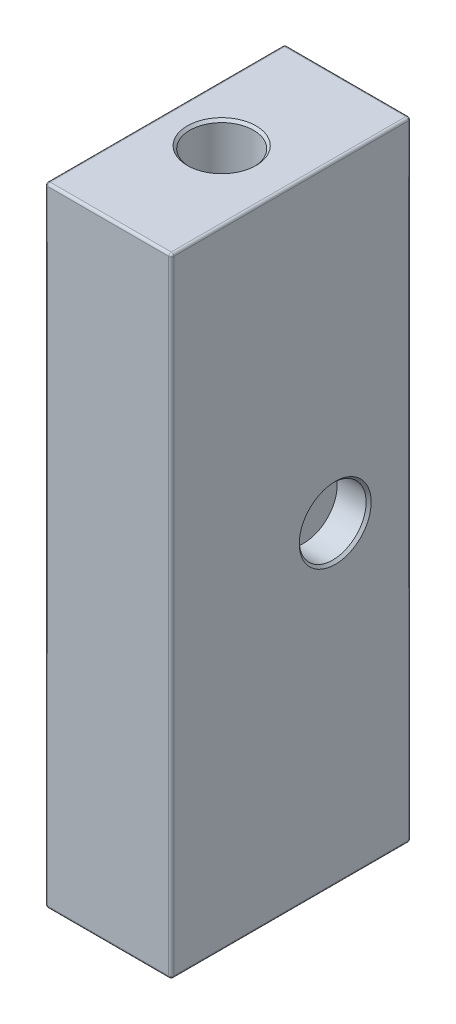
ISO-10303-21;
HEADER;
FILE_DESCRIPTION(('STEP AP214'),'2;1');
FILE_NAME('part.step','',(''),(''),'','','');
FILE_SCHEMA(('AUTOMOTIVE_DESIGN { 1 0 10303 214 1 1 1 1 }'));
ENDSEC;
DATA;
#1=APPLICATION_CONTEXT('core data for automotive mechanical design processes');
#2=APPLICATION_PROTOCOL_DEFINITION('international standard','automotive_design',2000,#1);
#3=PRODUCT_CONTEXT('',#1,'mechanical');
#4=PRODUCT('Part','Part','',(#3));
#5=PRODUCT_RELATED_PRODUCT_CATEGORY('part','',(#4));
#6=PRODUCT_DEFINITION_FORMATION('','',#4);
#7=PRODUCT_DEFINITION_CONTEXT('part definition',#1,'design');
#8=PRODUCT_DEFINITION('design','',#6,#7);
#9=PRODUCT_DEFINITION_SHAPE('','',#8);
#10=(LENGTH_UNIT() NAMED_UNIT(*) SI_UNIT(.MILLI.,.METRE.));
#11=(NAMED_UNIT(*) PLANE_ANGLE_UNIT() SI_UNIT($,.RADIAN.));
#12=(NAMED_UNIT(*) SI_UNIT($,.STERADIAN.) SOLID_ANGLE_UNIT());
#13=UNCERTAINTY_MEASURE_WITH_UNIT(LENGTH_MEASURE(1.E-05),#10,'distance_accuracy_value','');
#14=(GEOMETRIC_REPRESENTATION_CONTEXT(3) GLOBAL_UNCERTAINTY_ASSIGNED_CONTEXT((#13)) GLOBAL_UNIT_ASSIGNED_CONTEXT((#10,
#11,#12)) REPRESENTATION_CONTEXT('',''));
#15=CARTESIAN_POINT('',(0.,0.,0.));
#16=DIRECTION('',(0.,0.,1.));
#17=DIRECTION('',(1.,0.,0.));
#18=AXIS2_PLACEMENT_3D('',#15,#16,#17);
#19=CARTESIAN_POINT('',(0.,24.9,0.));
#20=DIRECTION('',(0.,1.,0.));
#21=DIRECTION('',(0.,0.,1.));
#22=AXIS2_PLACEMENT_3D('',#19,#20,#21);
#23=PLANE('',#22);
#24=CARTESIAN_POINT('',(-0.5,24.9,0.));
#25=DIRECTION('',(0.,1.,0.));
#26=DIRECTION('',(0.,0.,1.));
#27=AXIS2_PLACEMENT_3D('',#24,#25,#26);
#28=CIRCLE('',#27,2.72499999999999);
#29=CARTESIAN_POINT('',(-0.5,24.9,2.72500000000001));
#30=VERTEX_POINT('',#29);
#31=EDGE_CURVE('E11',#30,#30,#28,.F.);
#32=ORIENTED_EDGE('',*,*,#31,.T.);
#33=EDGE_LOOP('',(#32));
#34=FACE_BOUND('',#33,.T.);
#35=DIRECTION('',(-1.,0.,0.));
#36=VECTOR('',#35,1.);
#37=CARTESIAN_POINT('',(-5.,24.9,-9.3));
#38=LINE('',#37,#36);
#39=CARTESIAN_POINT('',(4.8,24.9,-9.3));
#40=VERTEX_POINT('',#39);
#41=CARTESIAN_POINT('',(-4.8,24.9,-9.3));
#42=VERTEX_POINT('',#41);
#43=EDGE_CURVE('E438',#40,#42,#38,.T.);
#44=ORIENTED_EDGE('',*,*,#43,.T.);
#45=DIRECTION('',(0.,0.,1.));
#46=VECTOR('',#45,1.);
#47=CARTESIAN_POINT('',(-4.8,24.9,9.5));
#48=LINE('',#47,#46);
#49=CARTESIAN_POINT('',(-4.8,24.9,9.3));
#50=VERTEX_POINT('',#49);
#51=EDGE_CURVE('E442',#42,#50,#48,.T.);
#52=ORIENTED_EDGE('',*,*,#51,.T.);
#53=DIRECTION('',(1.,0.,0.));
#54=VECTOR('',#53,1.);
#55=CARTESIAN_POINT('',(5.,24.9,9.3));
#56=LINE('',#55,#54);
#57=CARTESIAN_POINT('',(4.8,24.9,9.3));
#58=VERTEX_POINT('',#57);
#59=EDGE_CURVE('E435',#50,#58,#56,.T.);
#60=ORIENTED_EDGE('',*,*,#59,.T.);
#61=DIRECTION('',(0.,0.,-1.));
#62=VECTOR('',#61,1.);
#63=CARTESIAN_POINT('',(4.8,24.9,-9.5));
#64=LINE('',#63,#62);
#65=EDGE_CURVE('E418',#58,#40,#64,.T.);
#66=ORIENTED_EDGE('',*,*,#65,.T.);
#67=EDGE_LOOP('',(#44,#52,#60,#66));
#68=FACE_BOUND('',#67,.T.);
#69=ADVANCED_FACE('F45',(#34,#68),#23,.T.);
#70=CARTESIAN_POINT('',(0.,-24.9,0.));
#71=DIRECTION('',(0.,1.,0.));
#72=DIRECTION('',(0.,0.,1.));
#73=AXIS2_PLACEMENT_3D('',#70,#71,#72);
#74=PLANE('',#73);
#75=DIRECTION('',(1.,0.,0.));
#76=VECTOR('',#75,1.);
#77=CARTESIAN_POINT('',(0.,-24.9,9.3));
#78=LINE('',#77,#76);
#79=CARTESIAN_POINT('',(4.8,-24.9,9.3));
#80=VERTEX_POINT('',#79);
#81=CARTESIAN_POINT('',(-4.8,-24.9,9.3));
#82=VERTEX_POINT('',#81);
#83=EDGE_CURVE('E448',#80,#82,#78,.F.);
#84=ORIENTED_EDGE('',*,*,#83,.T.);
#85=DIRECTION('',(0.,0.,1.));
#86=VECTOR('',#85,1.);
#87=CARTESIAN_POINT('',(-4.8,-24.9,0.));
#88=LINE('',#87,#86);
#89=CARTESIAN_POINT('',(-4.8,-24.9,-9.3));
#90=VERTEX_POINT('',#89);
#91=EDGE_CURVE('E453',#82,#90,#88,.F.);
#92=ORIENTED_EDGE('',*,*,#91,.T.);
#93=DIRECTION('',(-1.,0.,0.));
#94=VECTOR('',#93,1.);
#95=CARTESIAN_POINT('',(0.,-24.9,-9.3));
#96=LINE('',#95,#94);
#97=CARTESIAN_POINT('',(4.8,-24.9,-9.3));
#98=VERTEX_POINT('',#97);
#99=EDGE_CURVE('E172',#90,#98,#96,.F.);
#100=ORIENTED_EDGE('',*,*,#99,.T.);
#101=DIRECTION('',(0.,0.,-1.));
#102=VECTOR('',#101,1.);
#103=CARTESIAN_POINT('',(4.8,-24.9,0.));
#104=LINE('',#103,#102);
#105=EDGE_CURVE('E445',#98,#80,#104,.F.);
#106=ORIENTED_EDGE('',*,*,#105,.T.);
#107=EDGE_LOOP('',(#84,#92,#100,#106));
#108=FACE_BOUND('',#107,.T.);
#109=CARTESIAN_POINT('',(-0.5,-24.9,0.));
#110=DIRECTION('',(0.,1.,0.));
#111=DIRECTION('',(0.,0.,1.));
#112=AXIS2_PLACEMENT_3D('',#109,#110,#111);
#113=CIRCLE('',#112,2.525);
#114=CARTESIAN_POINT('',(-0.5,-24.9,2.52500000000002));
#115=VERTEX_POINT('',#114);
#116=EDGE_CURVE('E159',#115,#115,#113,.T.);
#117=ORIENTED_EDGE('',*,*,#116,.T.);
#118=EDGE_LOOP('',(#117));
#119=FACE_BOUND('',#118,.T.);
#120=ADVANCED_FACE('F262',(#108,#119),#74,.F.);
#121=CARTESIAN_POINT('',(-5.,24.9,9.5));
#122=DIRECTION('',(1.,0.,0.));
#123=DIRECTION('',(0.,0.,-1.));
#124=AXIS2_PLACEMENT_3D('',#121,#122,#123);
#125=PLANE('',#124);
#126=DIRECTION('',(0.,0.,1.));
#127=VECTOR('',#126,1.);
#128=CARTESIAN_POINT('',(-5.,24.7,-9.5));
#129=LINE('',#128,#127);
#130=CARTESIAN_POINT('',(-5.,24.7,9.3));
#131=VERTEX_POINT('',#130);
#132=CARTESIAN_POINT('',(-5.,24.7,-9.3));
#133=VERTEX_POINT('',#132);
#134=EDGE_CURVE('E62',#131,#133,#129,.F.);
#135=ORIENTED_EDGE('',*,*,#134,.T.);
#136=DIRECTION('',(0.,-1.,0.));
#137=VECTOR('',#136,1.);
#138=CARTESIAN_POINT('',(-5.,24.9,-9.3));
#139=LINE('',#138,#137);
#140=CARTESIAN_POINT('',(-5.,-24.7,-9.3));
#141=VERTEX_POINT('',#140);
#142=EDGE_CURVE('E242',#133,#141,#139,.T.);
#143=ORIENTED_EDGE('',*,*,#142,.T.);
#144=DIRECTION('',(0.,0.,1.));
#145=VECTOR('',#144,1.);
#146=CARTESIAN_POINT('',(-5.,-24.7,9.5));
#147=LINE('',#146,#145);
#148=CARTESIAN_POINT('',(-5.,-24.7,9.3));
#149=VERTEX_POINT('',#148);
#150=EDGE_CURVE('E385',#141,#149,#147,.T.);
#151=ORIENTED_EDGE('',*,*,#150,.T.);
#152=DIRECTION('',(0.,-1.,0.));
#153=VECTOR('',#152,1.);
#154=CARTESIAN_POINT('',(-5.,24.9,9.3));
#155=LINE('',#154,#153);
#156=EDGE_CURVE('E67',#149,#131,#155,.F.);
#157=ORIENTED_EDGE('',*,*,#156,.T.);
#158=EDGE_LOOP('',(#135,#143,#151,#157));
#159=FACE_BOUND('',#158,.T.);
#160=ADVANCED_FACE('F268',(#159),#125,.F.);
#161=CARTESIAN_POINT('',(5.,24.9,9.5));
#162=DIRECTION('',(0.,0.,-1.));
#163=DIRECTION('',(-1.,0.,0.));
#164=AXIS2_PLACEMENT_3D('',#161,#162,#163);
#165=PLANE('',#164);
#166=DIRECTION('',(0.,-1.,0.));
#167=VECTOR('',#166,1.);
#168=CARTESIAN_POINT('',(4.8,24.9,9.5));
#169=LINE('',#168,#167);
#170=CARTESIAN_POINT('',(4.8,-24.7,9.5));
#171=VERTEX_POINT('',#170);
#172=CARTESIAN_POINT('',(4.8,24.7,9.5));
#173=VERTEX_POINT('',#172);
#174=EDGE_CURVE('E461',#171,#173,#169,.F.);
#175=ORIENTED_EDGE('',*,*,#174,.T.);
#176=DIRECTION('',(1.,0.,0.));
#177=VECTOR('',#176,1.);
#178=CARTESIAN_POINT('',(-5.,24.7,9.5));
#179=LINE('',#178,#177);
#180=CARTESIAN_POINT('',(-4.8,24.7,9.5));
#181=VERTEX_POINT('',#180);
#182=EDGE_CURVE('E464',#173,#181,#179,.F.);
#183=ORIENTED_EDGE('',*,*,#182,.T.);
#184=DIRECTION('',(0.,-1.,0.));
#185=VECTOR('',#184,1.);
#186=CARTESIAN_POINT('',(-4.8,24.9,9.5));
#187=LINE('',#186,#185);
#188=CARTESIAN_POINT('',(-4.8,-24.7,9.5));
#189=VERTEX_POINT('',#188);
#190=EDGE_CURVE('E374',#181,#189,#187,.T.);
#191=ORIENTED_EDGE('',*,*,#190,.T.);
#192=DIRECTION('',(1.,0.,0.));
#193=VECTOR('',#192,1.);
#194=CARTESIAN_POINT('',(5.,-24.7,9.5));
#195=LINE('',#194,#193);
#196=EDGE_CURVE('E458',#189,#171,#195,.T.);
#197=ORIENTED_EDGE('',*,*,#196,.T.);
#198=EDGE_LOOP('',(#175,#183,#191,#197));
#199=FACE_BOUND('',#198,.T.);
#200=ADVANCED_FACE('F280',(#199),#165,.F.);
#201=CARTESIAN_POINT('',(5.,24.9,9.5));
#202=DIRECTION('',(-1.,0.,0.));
#203=DIRECTION('',(0.,0.,1.));
#204=AXIS2_PLACEMENT_3D('',#201,#202,#203);
#205=PLANE('',#204);
#206=CARTESIAN_POINT('',(5.,0.,-3.5));
#207=DIRECTION('',(-1.,0.,0.));
#208=DIRECTION('',(0.,0.,1.));
#209=AXIS2_PLACEMENT_3D('',#206,#207,#208);
#210=CIRCLE('',#209,2.84999999999999);
#211=CARTESIAN_POINT('',(5.,0.,-0.650000000000012));
#212=VERTEX_POINT('',#211);
#213=EDGE_CURVE('E241',#212,#212,#210,.T.);
#214=ORIENTED_EDGE('',*,*,#213,.T.);
#215=EDGE_LOOP('',(#214));
#216=FACE_BOUND('',#215,.T.);
#217=DIRECTION('',(0.,-1.,0.));
#218=VECTOR('',#217,1.);
#219=CARTESIAN_POINT('',(5.,24.9,-9.3));
#220=LINE('',#219,#218);
#221=CARTESIAN_POINT('',(5.,-24.7,-9.3));
#222=VERTEX_POINT('',#221);
#223=CARTESIAN_POINT('',(5.,24.7,-9.3));
#224=VERTEX_POINT('',#223);
#225=EDGE_CURVE('E419',#222,#224,#220,.F.);
#226=ORIENTED_EDGE('',*,*,#225,.T.);
#227=DIRECTION('',(0.,0.,-1.));
#228=VECTOR('',#227,1.);
#229=CARTESIAN_POINT('',(5.,24.7,9.5));
#230=LINE('',#229,#228);
#231=CARTESIAN_POINT('',(5.,24.7,9.3));
#232=VERTEX_POINT('',#231);
#233=EDGE_CURVE('E412',#224,#232,#230,.F.);
#234=ORIENTED_EDGE('',*,*,#233,.T.);
#235=DIRECTION('',(0.,-1.,0.));
#236=VECTOR('',#235,1.);
#237=CARTESIAN_POINT('',(5.,24.9,9.3));
#238=LINE('',#237,#236);
#239=CARTESIAN_POINT('',(5.,-24.7,9.3));
#240=VERTEX_POINT('',#239);
#241=EDGE_CURVE('E427',#232,#240,#238,.T.);
#242=ORIENTED_EDGE('',*,*,#241,.T.);
#243=DIRECTION('',(0.,0.,-1.));
#244=VECTOR('',#243,1.);
#245=CARTESIAN_POINT('',(5.,-24.7,9.5));
#246=LINE('',#245,#244);
#247=EDGE_CURVE('E423',#240,#222,#246,.T.);
#248=ORIENTED_EDGE('',*,*,#247,.T.);
#249=EDGE_LOOP('',(#226,#234,#242,#248));
#250=FACE_BOUND('',#249,.T.);
#251=ADVANCED_FACE('F277',(#216,#250),#205,.F.);
#252=CARTESIAN_POINT('',(5.,24.9,-9.5));
#253=DIRECTION('',(0.,0.,1.));
#254=DIRECTION('',(1.,0.,0.));
#255=AXIS2_PLACEMENT_3D('',#252,#253,#254);
#256=PLANE('',#255);
#257=DIRECTION('',(-1.,0.,0.));
#258=VECTOR('',#257,1.);
#259=CARTESIAN_POINT('',(5.,24.7,-9.5));
#260=LINE('',#259,#258);
#261=CARTESIAN_POINT('',(-4.8,24.7,-9.5));
#262=VERTEX_POINT('',#261);
#263=CARTESIAN_POINT('',(4.8,24.7,-9.5));
#264=VERTEX_POINT('',#263);
#265=EDGE_CURVE('E147',#262,#264,#260,.F.);
#266=ORIENTED_EDGE('',*,*,#265,.T.);
#267=DIRECTION('',(0.,-1.,0.));
#268=VECTOR('',#267,1.);
#269=CARTESIAN_POINT('',(4.8,24.9,-9.5));
#270=LINE('',#269,#268);
#271=CARTESIAN_POINT('',(4.8,-24.7,-9.5));
#272=VERTEX_POINT('',#271);
#273=EDGE_CURVE('E142',#264,#272,#270,.T.);
#274=ORIENTED_EDGE('',*,*,#273,.T.);
#275=DIRECTION('',(-1.,0.,0.));
#276=VECTOR('',#275,1.);
#277=CARTESIAN_POINT('',(5.,-24.7,-9.5));
#278=LINE('',#277,#276);
#279=CARTESIAN_POINT('',(-4.8,-24.7,-9.5));
#280=VERTEX_POINT('',#279);
#281=EDGE_CURVE('E136',#272,#280,#278,.T.);
#282=ORIENTED_EDGE('',*,*,#281,.T.);
#283=DIRECTION('',(0.,-1.,0.));
#284=VECTOR('',#283,1.);
#285=CARTESIAN_POINT('',(-4.8,24.9,-9.5));
#286=LINE('',#285,#284);
#287=EDGE_CURVE('E139',#280,#262,#286,.F.);
#288=ORIENTED_EDGE('',*,*,#287,.T.);
#289=EDGE_LOOP('',(#266,#274,#282,#288));
#290=FACE_BOUND('',#289,.T.);
#291=ADVANCED_FACE('F138',(#290),#256,.F.);
#292=CARTESIAN_POINT('',(-0.5,24.9,0.));
#293=DIRECTION('',(0.,-1.,0.));
#294=DIRECTION('',(0.,0.,-1.));
#295=AXIS2_PLACEMENT_3D('',#292,#293,#294);
#296=CYLINDRICAL_SURFACE('',#295,2.525);
#297=CARTESIAN_POINT('',(-0.5,24.7,0.));
#298=DIRECTION('',(0.,1.,0.));
#299=DIRECTION('',(0.,0.,1.));
#300=AXIS2_PLACEMENT_3D('',#297,#298,#299);
#301=CIRCLE('',#300,2.525);
#302=CARTESIAN_POINT('',(-0.5,24.7,2.52500000000002));
#303=VERTEX_POINT('',#302);
#304=EDGE_CURVE('E55',#303,#303,#301,.T.);
#305=ORIENTED_EDGE('',*,*,#304,.T.);
#306=EDGE_LOOP('',(#305));
#307=FACE_BOUND('',#306,.T.);
#308=ORIENTED_EDGE('',*,*,#116,.F.);
#309=EDGE_LOOP('',(#308));
#310=FACE_BOUND('',#309,.T.);
#311=ADVANCED_FACE('F249',(#307,#310),#296,.F.);
#312=CARTESIAN_POINT('',(2.5,0.,-3.5));
#313=DIRECTION('',(1.,0.,0.));
#314=DIRECTION('',(0.,0.,-1.));
#315=AXIS2_PLACEMENT_3D('',#312,#313,#314);
#316=CYLINDRICAL_SURFACE('',#315,2.65);
#317=CARTESIAN_POINT('',(4.8,0.,-3.5));
#318=DIRECTION('',(-1.,0.,0.));
#319=DIRECTION('',(0.,0.,1.));
#320=AXIS2_PLACEMENT_3D('',#317,#318,#319);
#321=CIRCLE('',#320,2.65);
#322=CARTESIAN_POINT('',(4.8,0.,-0.850000000000007));
#323=VERTEX_POINT('',#322);
#324=EDGE_CURVE('E237',#323,#323,#321,.F.);
#325=ORIENTED_EDGE('',*,*,#324,.T.);
#326=EDGE_LOOP('',(#325));
#327=FACE_BOUND('',#326,.T.);
#328=CARTESIAN_POINT('',(2.5,0.,-3.5));
#329=DIRECTION('',(1.,0.,0.));
#330=DIRECTION('',(0.,0.,-1.));
#331=AXIS2_PLACEMENT_3D('',#328,#329,#330);
#332=CIRCLE('',#331,2.65);
#333=CARTESIAN_POINT('',(2.5,0.,-6.15));
#334=VERTEX_POINT('',#333);
#335=EDGE_CURVE('E236',#334,#334,#332,.T.);
#336=ORIENTED_EDGE('',*,*,#335,.F.);
#337=EDGE_LOOP('',(#336));
#338=FACE_BOUND('',#337,.T.);
#339=ADVANCED_FACE('F368',(#327,#338),#316,.F.);
#340=CARTESIAN_POINT('',(2.5,0.,-3.5));
#341=DIRECTION('',(1.,0.,0.));
#342=DIRECTION('',(0.,0.,-1.));
#343=AXIS2_PLACEMENT_3D('',#340,#341,#342);
#344=PLANE('',#343);
#345=ORIENTED_EDGE('',*,*,#335,.T.);
#346=EDGE_LOOP('',(#345));
#347=FACE_BOUND('',#346,.T.);
#348=ADVANCED_FACE('F358',(#347),#344,.T.);
#349=CARTESIAN_POINT('',(-4.8,24.9,9.3));
#350=DIRECTION('',(0.,-1.,0.));
#351=DIRECTION('',(0.,0.,-1.));
#352=AXIS2_PLACEMENT_3D('',#349,#350,#351);
#353=CYLINDRICAL_SURFACE('',#352,0.2);
#354=CARTESIAN_POINT('',(-4.8,24.7,9.3));
#355=DIRECTION('',(0.,1.,0.));
#356=DIRECTION('',(0.,0.,1.));
#357=AXIS2_PLACEMENT_3D('',#354,#355,#356);
#358=CIRCLE('',#357,0.2);
#359=EDGE_CURVE('E232',#131,#181,#358,.T.);
#360=ORIENTED_EDGE('',*,*,#359,.F.);
#361=ORIENTED_EDGE('',*,*,#156,.F.);
#362=CARTESIAN_POINT('',(-4.8,-24.7,9.3));
#363=DIRECTION('',(0.,-1.,0.));
#364=DIRECTION('',(0.,0.,-1.));
#365=AXIS2_PLACEMENT_3D('',#362,#363,#364);
#366=CIRCLE('',#365,0.2);
#367=EDGE_CURVE('E228',#189,#149,#366,.T.);
#368=ORIENTED_EDGE('',*,*,#367,.F.);
#369=ORIENTED_EDGE('',*,*,#190,.F.);
#370=EDGE_LOOP('',(#360,#361,#368,#369));
#371=FACE_BOUND('',#370,.T.);
#372=ADVANCED_FACE('F355',(#371),#353,.T.);
#373=CARTESIAN_POINT('',(-4.8,24.7,9.3));
#374=DIRECTION('',(0.,0.,1.));
#375=DIRECTION('',(1.,0.,0.));
#376=AXIS2_PLACEMENT_3D('',#373,#374,#375);
#377=SPHERICAL_SURFACE('',#376,0.2);
#378=CARTESIAN_POINT('',(-4.8,24.7,9.3));
#379=DIRECTION('',(0.,0.,1.));
#380=DIRECTION('',(1.,0.,0.));
#381=AXIS2_PLACEMENT_3D('',#378,#379,#380);
#382=CIRCLE('',#381,0.2);
#383=EDGE_CURVE('E221',#131,#50,#382,.F.);
#384=ORIENTED_EDGE('',*,*,#383,.F.);
#385=ORIENTED_EDGE('',*,*,#359,.T.);
#386=CARTESIAN_POINT('',(-4.8,24.7,9.3));
#387=DIRECTION('',(-1.,0.,0.));
#388=DIRECTION('',(0.,-1.,0.));
#389=AXIS2_PLACEMENT_3D('',#386,#387,#388);
#390=CIRCLE('',#389,0.2);
#391=EDGE_CURVE('E225',#50,#181,#390,.F.);
#392=ORIENTED_EDGE('',*,*,#391,.F.);
#393=EDGE_LOOP('',(#384,#385,#392));
#394=FACE_BOUND('',#393,.T.);
#395=ADVANCED_FACE('F351',(#394),#377,.T.);
#396=CARTESIAN_POINT('',(-4.8,-24.7,9.3));
#397=DIRECTION('',(-1.,0.,0.));
#398=DIRECTION('',(0.,0.,1.));
#399=AXIS2_PLACEMENT_3D('',#396,#397,#398);
#400=SPHERICAL_SURFACE('',#399,0.2);
#401=CARTESIAN_POINT('',(-4.8,-24.7,9.3));
#402=DIRECTION('',(-1.,0.,0.));
#403=DIRECTION('',(0.,0.,1.));
#404=AXIS2_PLACEMENT_3D('',#401,#402,#403);
#405=CIRCLE('',#404,0.2);
#406=EDGE_CURVE('E213',#189,#82,#405,.F.);
#407=ORIENTED_EDGE('',*,*,#406,.F.);
#408=ORIENTED_EDGE('',*,*,#367,.T.);
#409=CARTESIAN_POINT('',(-4.8,-24.7,9.3));
#410=DIRECTION('',(0.,0.,1.));
#411=DIRECTION('',(1.,0.,0.));
#412=AXIS2_PLACEMENT_3D('',#409,#410,#411);
#413=CIRCLE('',#412,0.2);
#414=EDGE_CURVE('E217',#82,#149,#413,.F.);
#415=ORIENTED_EDGE('',*,*,#414,.F.);
#416=EDGE_LOOP('',(#407,#408,#415));
#417=FACE_BOUND('',#416,.T.);
#418=ADVANCED_FACE('F347',(#417),#400,.T.);
#419=CARTESIAN_POINT('',(0.,24.7,9.3));
#420=DIRECTION('',(-1.,0.,0.));
#421=DIRECTION('',(0.,0.,1.));
#422=AXIS2_PLACEMENT_3D('',#419,#420,#421);
#423=CYLINDRICAL_SURFACE('',#422,0.2);
#424=ORIENTED_EDGE('',*,*,#391,.T.);
#425=ORIENTED_EDGE('',*,*,#182,.F.);
#426=CARTESIAN_POINT('',(4.8,24.7,9.3));
#427=DIRECTION('',(1.,0.,0.));
#428=DIRECTION('',(0.,0.,-1.));
#429=AXIS2_PLACEMENT_3D('',#426,#427,#428);
#430=CIRCLE('',#429,0.2);
#431=EDGE_CURVE('E205',#58,#173,#430,.T.);
#432=ORIENTED_EDGE('',*,*,#431,.F.);
#433=ORIENTED_EDGE('',*,*,#59,.F.);
#434=EDGE_LOOP('',(#424,#425,#432,#433));
#435=FACE_BOUND('',#434,.T.);
#436=ADVANCED_FACE('F343',(#435),#423,.T.);
#437=CARTESIAN_POINT('',(-4.8,24.7,0.));
#438=DIRECTION('',(0.,0.,-1.));
#439=DIRECTION('',(-1.,0.,0.));
#440=AXIS2_PLACEMENT_3D('',#437,#438,#439);
#441=CYLINDRICAL_SURFACE('',#440,0.2);
#442=ORIENTED_EDGE('',*,*,#383,.T.);
#443=ORIENTED_EDGE('',*,*,#51,.F.);
#444=CARTESIAN_POINT('',(-4.8,24.7,-9.3));
#445=DIRECTION('',(0.,0.,-1.));
#446=DIRECTION('',(0.,1.,0.));
#447=AXIS2_PLACEMENT_3D('',#444,#445,#446);
#448=CIRCLE('',#447,0.2);
#449=EDGE_CURVE('E201',#133,#42,#448,.T.);
#450=ORIENTED_EDGE('',*,*,#449,.F.);
#451=ORIENTED_EDGE('',*,*,#134,.F.);
#452=EDGE_LOOP('',(#442,#443,#450,#451));
#453=FACE_BOUND('',#452,.T.);
#454=ADVANCED_FACE('F340',(#453),#441,.T.);
#455=CARTESIAN_POINT('',(-4.8,24.9,-9.3));
#456=DIRECTION('',(0.,-1.,0.));
#457=DIRECTION('',(0.,0.,-1.));
#458=AXIS2_PLACEMENT_3D('',#455,#456,#457);
#459=CYLINDRICAL_SURFACE('',#458,0.2);
#460=CARTESIAN_POINT('',(-4.8,-24.7,-9.3));
#461=DIRECTION('',(0.,-1.,0.));
#462=DIRECTION('',(0.,0.,-1.));
#463=AXIS2_PLACEMENT_3D('',#460,#461,#462);
#464=CIRCLE('',#463,0.2);
#465=EDGE_CURVE('E153',#141,#280,#464,.T.);
#466=ORIENTED_EDGE('',*,*,#465,.F.);
#467=ORIENTED_EDGE('',*,*,#142,.F.);
#468=CARTESIAN_POINT('',(-4.8,24.7,-9.3));
#469=DIRECTION('',(0.,1.,0.));
#470=DIRECTION('',(0.,0.,1.));
#471=AXIS2_PLACEMENT_3D('',#468,#469,#470);
#472=CIRCLE('',#471,0.2);
#473=EDGE_CURVE('E156',#262,#133,#472,.T.);
#474=ORIENTED_EDGE('',*,*,#473,.F.);
#475=ORIENTED_EDGE('',*,*,#287,.F.);
#476=EDGE_LOOP('',(#466,#467,#474,#475));
#477=FACE_BOUND('',#476,.T.);
#478=ADVANCED_FACE('F152',(#477),#459,.T.);
#479=CARTESIAN_POINT('',(-4.8,-24.7,9.5));
#480=DIRECTION('',(0.,0.,1.));
#481=DIRECTION('',(1.,0.,0.));
#482=AXIS2_PLACEMENT_3D('',#479,#480,#481);
#483=CYLINDRICAL_SURFACE('',#482,0.2);
#484=ORIENTED_EDGE('',*,*,#414,.T.);
#485=ORIENTED_EDGE('',*,*,#150,.F.);
#486=CARTESIAN_POINT('',(-4.8,-24.7,-9.3));
#487=DIRECTION('',(0.,0.,-1.));
#488=DIRECTION('',(-1.,0.,0.));
#489=AXIS2_PLACEMENT_3D('',#486,#487,#488);
#490=CIRCLE('',#489,0.2);
#491=EDGE_CURVE('E167',#90,#141,#490,.T.);
#492=ORIENTED_EDGE('',*,*,#491,.F.);
#493=ORIENTED_EDGE('',*,*,#91,.F.);
#494=EDGE_LOOP('',(#484,#485,#492,#493));
#495=FACE_BOUND('',#494,.T.);
#496=ADVANCED_FACE('F333',(#495),#483,.T.);
#497=CARTESIAN_POINT('',(5.,-24.7,9.3));
#498=DIRECTION('',(1.,0.,0.));
#499=DIRECTION('',(0.,0.,-1.));
#500=AXIS2_PLACEMENT_3D('',#497,#498,#499);
#501=CYLINDRICAL_SURFACE('',#500,0.2);
#502=ORIENTED_EDGE('',*,*,#406,.T.);
#503=ORIENTED_EDGE('',*,*,#83,.F.);
#504=CARTESIAN_POINT('',(4.8,-24.7,9.3));
#505=DIRECTION('',(1.,0.,0.));
#506=DIRECTION('',(0.,0.,-1.));
#507=AXIS2_PLACEMENT_3D('',#504,#505,#506);
#508=CIRCLE('',#507,0.2);
#509=EDGE_CURVE('E193',#171,#80,#508,.T.);
#510=ORIENTED_EDGE('',*,*,#509,.F.);
#511=ORIENTED_EDGE('',*,*,#196,.F.);
#512=EDGE_LOOP('',(#502,#503,#510,#511));
#513=FACE_BOUND('',#512,.T.);
#514=ADVANCED_FACE('F329',(#513),#501,.T.);
#515=CARTESIAN_POINT('',(4.8,24.9,9.3));
#516=DIRECTION('',(0.,-1.,0.));
#517=DIRECTION('',(0.,0.,-1.));
#518=AXIS2_PLACEMENT_3D('',#515,#516,#517);
#519=CYLINDRICAL_SURFACE('',#518,0.2);
#520=CARTESIAN_POINT('',(4.8,24.7,9.3));
#521=DIRECTION('',(0.,1.,0.));
#522=DIRECTION('',(0.,0.,1.));
#523=AXIS2_PLACEMENT_3D('',#520,#521,#522);
#524=CIRCLE('',#523,0.2);
#525=EDGE_CURVE('E209',#173,#232,#524,.T.);
#526=ORIENTED_EDGE('',*,*,#525,.F.);
#527=ORIENTED_EDGE('',*,*,#174,.F.);
#528=CARTESIAN_POINT('',(4.8,-24.7,9.3));
#529=DIRECTION('',(0.,-1.,0.));
#530=DIRECTION('',(0.,0.,-1.));
#531=AXIS2_PLACEMENT_3D('',#528,#529,#530);
#532=CIRCLE('',#531,0.2);
#533=EDGE_CURVE('E189',#240,#171,#532,.T.);
#534=ORIENTED_EDGE('',*,*,#533,.F.);
#535=ORIENTED_EDGE('',*,*,#241,.F.);
#536=EDGE_LOOP('',(#526,#527,#534,#535));
#537=FACE_BOUND('',#536,.T.);
#538=ADVANCED_FACE('F325',(#537),#519,.T.);
#539=CARTESIAN_POINT('',(4.8,24.7,9.3));
#540=DIRECTION('',(0.,0.,1.));
#541=DIRECTION('',(1.,0.,0.));
#542=AXIS2_PLACEMENT_3D('',#539,#540,#541);
#543=SPHERICAL_SURFACE('',#542,0.2);
#544=ORIENTED_EDGE('',*,*,#431,.T.);
#545=ORIENTED_EDGE('',*,*,#525,.T.);
#546=CARTESIAN_POINT('',(4.8,24.7,9.3));
#547=DIRECTION('',(0.,0.,1.));
#548=DIRECTION('',(1.,0.,0.));
#549=AXIS2_PLACEMENT_3D('',#546,#547,#548);
#550=CIRCLE('',#549,0.2);
#551=EDGE_CURVE('E179',#58,#232,#550,.F.);
#552=ORIENTED_EDGE('',*,*,#551,.F.);
#553=EDGE_LOOP('',(#544,#545,#552));
#554=FACE_BOUND('',#553,.T.);
#555=ADVANCED_FACE('F321',(#554),#543,.T.);
#556=CARTESIAN_POINT('',(-4.8,24.7,-9.3));
#557=DIRECTION('',(-1.,0.,0.));
#558=DIRECTION('',(0.,0.,1.));
#559=AXIS2_PLACEMENT_3D('',#556,#557,#558);
#560=SPHERICAL_SURFACE('',#559,0.2);
#561=ORIENTED_EDGE('',*,*,#473,.T.);
#562=ORIENTED_EDGE('',*,*,#449,.T.);
#563=CARTESIAN_POINT('',(-4.8,24.7,-9.3));
#564=DIRECTION('',(-1.,0.,0.));
#565=DIRECTION('',(0.,0.,1.));
#566=AXIS2_PLACEMENT_3D('',#563,#564,#565);
#567=CIRCLE('',#566,0.2);
#568=EDGE_CURVE('E174',#262,#42,#567,.F.);
#569=ORIENTED_EDGE('',*,*,#568,.F.);
#570=EDGE_LOOP('',(#561,#562,#569));
#571=FACE_BOUND('',#570,.T.);
#572=ADVANCED_FACE('F318',(#571),#560,.T.);
#573=CARTESIAN_POINT('',(-4.8,-24.7,-9.3));
#574=DIRECTION('',(-1.,0.,0.));
#575=DIRECTION('',(0.,0.,1.));
#576=AXIS2_PLACEMENT_3D('',#573,#574,#575);
#577=SPHERICAL_SURFACE('',#576,0.2);
#578=ORIENTED_EDGE('',*,*,#491,.T.);
#579=ORIENTED_EDGE('',*,*,#465,.T.);
#580=CARTESIAN_POINT('',(-4.8,-24.7,-9.3));
#581=DIRECTION('',(-1.,0.,0.));
#582=DIRECTION('',(0.,0.,1.));
#583=AXIS2_PLACEMENT_3D('',#580,#581,#582);
#584=CIRCLE('',#583,0.2);
#585=EDGE_CURVE('E164',#90,#280,#584,.F.);
#586=ORIENTED_EDGE('',*,*,#585,.F.);
#587=EDGE_LOOP('',(#578,#579,#586));
#588=FACE_BOUND('',#587,.T.);
#589=ADVANCED_FACE('F163',(#588),#577,.T.);
#590=CARTESIAN_POINT('',(4.8,-24.7,9.3));
#591=DIRECTION('',(0.,0.,1.));
#592=DIRECTION('',(1.,0.,0.));
#593=AXIS2_PLACEMENT_3D('',#590,#591,#592);
#594=SPHERICAL_SURFACE('',#593,0.2);
#595=ORIENTED_EDGE('',*,*,#533,.T.);
#596=ORIENTED_EDGE('',*,*,#509,.T.);
#597=CARTESIAN_POINT('',(4.8,-24.7,9.3));
#598=DIRECTION('',(0.,0.,1.));
#599=DIRECTION('',(1.,0.,0.));
#600=AXIS2_PLACEMENT_3D('',#597,#598,#599);
#601=CIRCLE('',#600,0.2);
#602=EDGE_CURVE('E175',#240,#80,#601,.F.);
#603=ORIENTED_EDGE('',*,*,#602,.F.);
#604=EDGE_LOOP('',(#595,#596,#603));
#605=FACE_BOUND('',#604,.T.);
#606=ADVANCED_FACE('F311',(#605),#594,.T.);
#607=CARTESIAN_POINT('',(4.8,24.7,0.));
#608=DIRECTION('',(0.,0.,1.));
#609=DIRECTION('',(1.,0.,0.));
#610=AXIS2_PLACEMENT_3D('',#607,#608,#609);
#611=CYLINDRICAL_SURFACE('',#610,0.2);
#612=ORIENTED_EDGE('',*,*,#551,.T.);
#613=ORIENTED_EDGE('',*,*,#233,.F.);
#614=CARTESIAN_POINT('',(4.8,24.7,-9.3));
#615=DIRECTION('',(0.,0.,-1.));
#616=DIRECTION('',(-1.,0.,0.));
#617=AXIS2_PLACEMENT_3D('',#614,#615,#616);
#618=CIRCLE('',#617,0.2);
#619=EDGE_CURVE('E182',#40,#224,#618,.T.);
#620=ORIENTED_EDGE('',*,*,#619,.F.);
#621=ORIENTED_EDGE('',*,*,#65,.F.);
#622=EDGE_LOOP('',(#612,#613,#620,#621));
#623=FACE_BOUND('',#622,.T.);
#624=ADVANCED_FACE('F307',(#623),#611,.T.);
#625=CARTESIAN_POINT('',(0.,24.7,-9.3));
#626=DIRECTION('',(1.,0.,0.));
#627=DIRECTION('',(0.,0.,-1.));
#628=AXIS2_PLACEMENT_3D('',#625,#626,#627);
#629=CYLINDRICAL_SURFACE('',#628,0.2);
#630=ORIENTED_EDGE('',*,*,#568,.T.);
#631=ORIENTED_EDGE('',*,*,#43,.F.);
#632=CARTESIAN_POINT('',(4.8,24.7,-9.3));
#633=DIRECTION('',(1.,0.,0.));
#634=DIRECTION('',(0.,0.,-1.));
#635=AXIS2_PLACEMENT_3D('',#632,#633,#634);
#636=CIRCLE('',#635,0.2);
#637=EDGE_CURVE('E402',#264,#40,#636,.T.);
#638=ORIENTED_EDGE('',*,*,#637,.F.);
#639=ORIENTED_EDGE('',*,*,#265,.F.);
#640=EDGE_LOOP('',(#630,#631,#638,#639));
#641=FACE_BOUND('',#640,.T.);
#642=ADVANCED_FACE('F304',(#641),#629,.T.);
#643=CARTESIAN_POINT('',(5.,-24.7,-9.3));
#644=DIRECTION('',(-1.,0.,0.));
#645=DIRECTION('',(0.,0.,1.));
#646=AXIS2_PLACEMENT_3D('',#643,#644,#645);
#647=CYLINDRICAL_SURFACE('',#646,0.2);
#648=ORIENTED_EDGE('',*,*,#585,.T.);
#649=ORIENTED_EDGE('',*,*,#281,.F.);
#650=CARTESIAN_POINT('',(4.8,-24.7,-9.3));
#651=DIRECTION('',(1.,0.,0.));
#652=DIRECTION('',(0.,0.,-1.));
#653=AXIS2_PLACEMENT_3D('',#650,#651,#652);
#654=CIRCLE('',#653,0.2);
#655=EDGE_CURVE('E398',#98,#272,#654,.T.);
#656=ORIENTED_EDGE('',*,*,#655,.F.);
#657=ORIENTED_EDGE('',*,*,#99,.F.);
#658=EDGE_LOOP('',(#648,#649,#656,#657));
#659=FACE_BOUND('',#658,.T.);
#660=ADVANCED_FACE('F170',(#659),#647,.T.);
#661=CARTESIAN_POINT('',(4.8,-24.7,9.5));
#662=DIRECTION('',(0.,0.,-1.));
#663=DIRECTION('',(-1.,0.,0.));
#664=AXIS2_PLACEMENT_3D('',#661,#662,#663);
#665=CYLINDRICAL_SURFACE('',#664,0.2);
#666=ORIENTED_EDGE('',*,*,#602,.T.);
#667=ORIENTED_EDGE('',*,*,#105,.F.);
#668=CARTESIAN_POINT('',(4.8,-24.7,-9.3));
#669=DIRECTION('',(0.,0.,-1.));
#670=DIRECTION('',(-1.,0.,0.));
#671=AXIS2_PLACEMENT_3D('',#668,#669,#670);
#672=CIRCLE('',#671,0.2);
#673=EDGE_CURVE('E395',#222,#98,#672,.T.);
#674=ORIENTED_EDGE('',*,*,#673,.F.);
#675=ORIENTED_EDGE('',*,*,#247,.F.);
#676=EDGE_LOOP('',(#666,#667,#674,#675));
#677=FACE_BOUND('',#676,.T.);
#678=ADVANCED_FACE('F297',(#677),#665,.T.);
#679=CARTESIAN_POINT('',(4.8,24.7,-9.3));
#680=DIRECTION('',(0.,1.,0.));
#681=DIRECTION('',(0.,0.,1.));
#682=AXIS2_PLACEMENT_3D('',#679,#680,#681);
#683=SPHERICAL_SURFACE('',#682,0.2);
#684=ORIENTED_EDGE('',*,*,#637,.T.);
#685=ORIENTED_EDGE('',*,*,#619,.T.);
#686=CARTESIAN_POINT('',(4.8,24.7,-9.3));
#687=DIRECTION('',(0.,1.,0.));
#688=DIRECTION('',(0.,0.,1.));
#689=AXIS2_PLACEMENT_3D('',#686,#687,#688);
#690=CIRCLE('',#689,0.2);
#691=EDGE_CURVE('E392',#264,#224,#690,.F.);
#692=ORIENTED_EDGE('',*,*,#691,.F.);
#693=EDGE_LOOP('',(#684,#685,#692));
#694=FACE_BOUND('',#693,.T.);
#695=ADVANCED_FACE('F293',(#694),#683,.T.);
#696=CARTESIAN_POINT('',(4.8,-24.7,-9.3));
#697=DIRECTION('',(0.,-1.,0.));
#698=DIRECTION('',(0.,0.,-1.));
#699=AXIS2_PLACEMENT_3D('',#696,#697,#698);
#700=SPHERICAL_SURFACE('',#699,0.2);
#701=ORIENTED_EDGE('',*,*,#673,.T.);
#702=ORIENTED_EDGE('',*,*,#655,.T.);
#703=CARTESIAN_POINT('',(4.8,-24.7,-9.3));
#704=DIRECTION('',(0.,-1.,0.));
#705=DIRECTION('',(0.,0.,-1.));
#706=AXIS2_PLACEMENT_3D('',#703,#704,#705);
#707=CIRCLE('',#706,0.2);
#708=EDGE_CURVE('E389',#222,#272,#707,.F.);
#709=ORIENTED_EDGE('',*,*,#708,.F.);
#710=EDGE_LOOP('',(#701,#702,#709));
#711=FACE_BOUND('',#710,.T.);
#712=ADVANCED_FACE('F289',(#711),#700,.T.);
#713=CARTESIAN_POINT('',(4.8,24.9,-9.3));
#714=DIRECTION('',(0.,-1.,0.));
#715=DIRECTION('',(0.,0.,-1.));
#716=AXIS2_PLACEMENT_3D('',#713,#714,#715);
#717=CYLINDRICAL_SURFACE('',#716,0.2);
#718=ORIENTED_EDGE('',*,*,#691,.T.);
#719=ORIENTED_EDGE('',*,*,#225,.F.);
#720=ORIENTED_EDGE('',*,*,#708,.T.);
#721=ORIENTED_EDGE('',*,*,#273,.F.);
#722=EDGE_LOOP('',(#718,#719,#720,#721));
#723=FACE_BOUND('',#722,.T.);
#724=ADVANCED_FACE('F258',(#723),#717,.T.);
#725=CARTESIAN_POINT('',(4.8,0.,-3.5));
#726=DIRECTION('',(1.,0.,0.));
#727=DIRECTION('',(0.,0.,-1.));
#728=AXIS2_PLACEMENT_3D('',#725,#726,#727);
#729=CONICAL_SURFACE('',#728,2.65,0.78539816339743);
#730=ORIENTED_EDGE('',*,*,#213,.F.);
#731=EDGE_LOOP('',(#730));
#732=FACE_BOUND('',#731,.T.);
#733=ORIENTED_EDGE('',*,*,#324,.F.);
#734=EDGE_LOOP('',(#733));
#735=FACE_BOUND('',#734,.T.);
#736=ADVANCED_FACE('F253',(#732,#735),#729,.F.);
#737=CARTESIAN_POINT('',(-0.5,24.7,0.));
#738=DIRECTION('',(0.,1.,0.));
#739=DIRECTION('',(0.,0.,1.));
#740=AXIS2_PLACEMENT_3D('',#737,#738,#739);
#741=CONICAL_SURFACE('',#740,2.525,0.785398163397448);
#742=ORIENTED_EDGE('',*,*,#31,.F.);
#743=EDGE_LOOP('',(#742));
#744=FACE_BOUND('',#743,.T.);
#745=ORIENTED_EDGE('',*,*,#304,.F.);
#746=EDGE_LOOP('',(#745));
#747=FACE_BOUND('',#746,.T.);
#748=ADVANCED_FACE('F48',(#744,#747),#741,.F.);
#749=CLOSED_SHELL('',(#69,#120,#160,#200,#251,#291,#311,#339,#348,#372,#395,#418,#436,#454,#478,
#496,#514,#538,#555,#572,#589,#606,#624,#642,#660,#678,#695,#712,#724,#736,#748));
#750=MANIFOLD_SOLID_BREP('B2',#749);
#751=ADVANCED_BREP_SHAPE_REPRESENTATION('',(#18,#750),#14);
#752=SHAPE_DEFINITION_REPRESENTATION(#9,#751);
ENDSEC;
END-ISO-10303-21;
